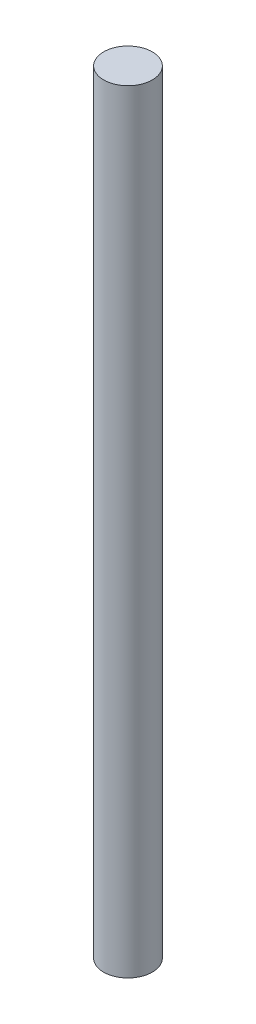
ISO-10303-21;
HEADER;
FILE_DESCRIPTION(('STEP AP214'),'2;1');
FILE_NAME('part.step','',(''),(''),'','','');
FILE_SCHEMA(('AUTOMOTIVE_DESIGN { 1 0 10303 214 1 1 1 1 }'));
ENDSEC;
DATA;
#1=APPLICATION_CONTEXT('core data for automotive mechanical design processes');
#2=APPLICATION_PROTOCOL_DEFINITION('international standard','automotive_design',2000,#1);
#3=PRODUCT_CONTEXT('',#1,'mechanical');
#4=PRODUCT('Part','Part','',(#3));
#5=PRODUCT_RELATED_PRODUCT_CATEGORY('part','',(#4));
#6=PRODUCT_DEFINITION_FORMATION('','',#4);
#7=PRODUCT_DEFINITION_CONTEXT('part definition',#1,'design');
#8=PRODUCT_DEFINITION('design','',#6,#7);
#9=PRODUCT_DEFINITION_SHAPE('','',#8);
#10=(LENGTH_UNIT() NAMED_UNIT(*) SI_UNIT(.MILLI.,.METRE.));
#11=(NAMED_UNIT(*) PLANE_ANGLE_UNIT() SI_UNIT($,.RADIAN.));
#12=(NAMED_UNIT(*) SI_UNIT($,.STERADIAN.) SOLID_ANGLE_UNIT());
#13=UNCERTAINTY_MEASURE_WITH_UNIT(LENGTH_MEASURE(1.E-05),#10,'distance_accuracy_value','');
#14=(GEOMETRIC_REPRESENTATION_CONTEXT(3) GLOBAL_UNCERTAINTY_ASSIGNED_CONTEXT((#13)) GLOBAL_UNIT_ASSIGNED_CONTEXT((#10,
#11,#12)) REPRESENTATION_CONTEXT('',''));
#15=CARTESIAN_POINT('',(0.,0.,0.));
#16=DIRECTION('',(0.,0.,1.));
#17=DIRECTION('',(1.,0.,0.));
#18=AXIS2_PLACEMENT_3D('',#15,#16,#17);
#19=CARTESIAN_POINT('',(0.,200.,0.));
#20=DIRECTION('',(0.,-1.,0.));
#21=DIRECTION('',(0.,0.,-1.));
#22=AXIS2_PLACEMENT_3D('',#19,#20,#21);
#23=CYLINDRICAL_SURFACE('',#22,6.3);
#24=CARTESIAN_POINT('',(0.,200.,0.));
#25=DIRECTION('',(0.,1.,0.));
#26=DIRECTION('',(0.,0.,1.));
#27=AXIS2_PLACEMENT_3D('',#24,#25,#26);
#28=CIRCLE('',#27,6.3);
#29=CARTESIAN_POINT('',(0.,200.,6.3));
#30=VERTEX_POINT('',#29);
#31=EDGE_CURVE('E10',#30,#30,#28,.T.);
#32=ORIENTED_EDGE('',*,*,#31,.F.);
#33=EDGE_LOOP('',(#32));
#34=FACE_BOUND('',#33,.T.);
#35=CARTESIAN_POINT('',(0.,0.,0.));
#36=DIRECTION('',(0.,1.,0.));
#37=DIRECTION('',(0.,0.,1.));
#38=AXIS2_PLACEMENT_3D('',#35,#36,#37);
#39=CIRCLE('',#38,6.3);
#40=CARTESIAN_POINT('',(0.,0.,6.3));
#41=VERTEX_POINT('',#40);
#42=EDGE_CURVE('E34',#41,#41,#39,.T.);
#43=ORIENTED_EDGE('',*,*,#42,.T.);
#44=EDGE_LOOP('',(#43));
#45=FACE_BOUND('',#44,.T.);
#46=ADVANCED_FACE('F31',(#34,#45),#23,.T.);
#47=CARTESIAN_POINT('',(0.,200.,0.));
#48=DIRECTION('',(0.,1.,0.));
#49=DIRECTION('',(0.,0.,1.));
#50=AXIS2_PLACEMENT_3D('',#47,#48,#49);
#51=PLANE('',#50);
#52=ORIENTED_EDGE('',*,*,#31,.T.);
#53=EDGE_LOOP('',(#52));
#54=FACE_BOUND('',#53,.T.);
#55=ADVANCED_FACE('F46',(#54),#51,.T.);
#56=CARTESIAN_POINT('',(0.,0.,0.));
#57=DIRECTION('',(0.,1.,0.));
#58=DIRECTION('',(0.,0.,1.));
#59=AXIS2_PLACEMENT_3D('',#56,#57,#58);
#60=PLANE('',#59);
#61=ORIENTED_EDGE('',*,*,#42,.F.);
#62=EDGE_LOOP('',(#61));
#63=FACE_BOUND('',#62,.T.);
#64=ADVANCED_FACE('F44',(#63),#60,.F.);
#65=CLOSED_SHELL('',(#46,#55,#64));
#66=MANIFOLD_SOLID_BREP('B2',#65);
#67=ADVANCED_BREP_SHAPE_REPRESENTATION('',(#18,#66),#14);
#68=SHAPE_DEFINITION_REPRESENTATION(#9,#67);
ENDSEC;
END-ISO-10303-21;
